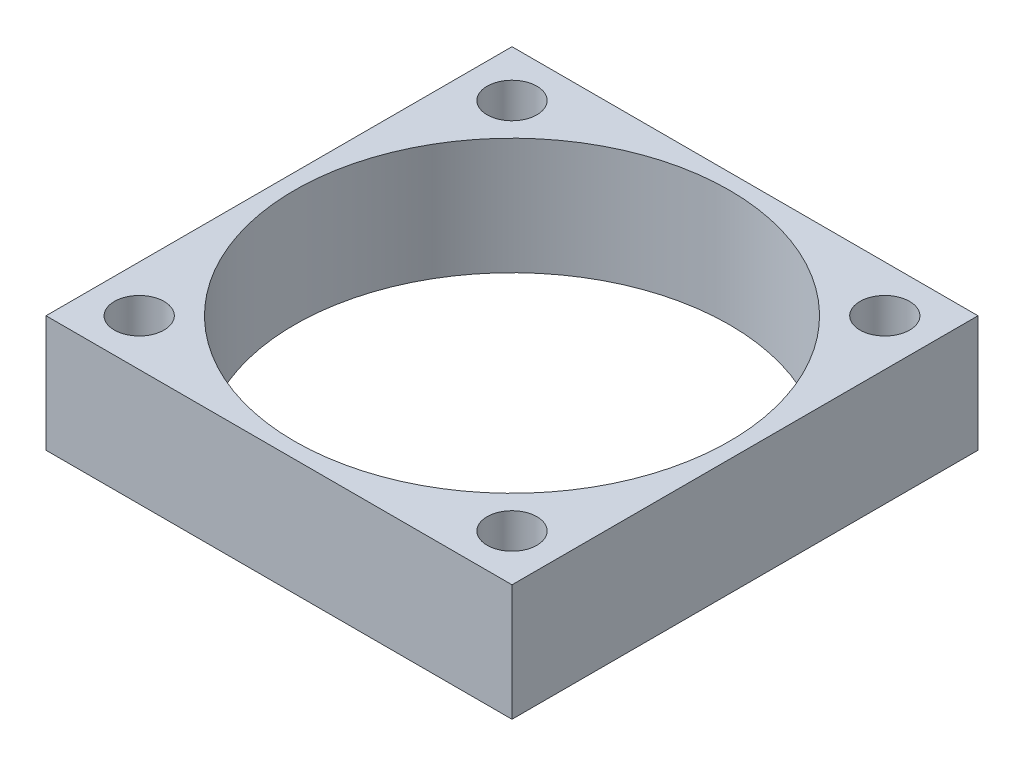
ISO-10303-21;
HEADER;
FILE_DESCRIPTION(('STEP AP214'),'2;1');
FILE_NAME('part.step','',(''),(''),'','','');
FILE_SCHEMA(('AUTOMOTIVE_DESIGN { 1 0 10303 214 1 1 1 1 }'));
ENDSEC;
DATA;
#1=APPLICATION_CONTEXT('core data for automotive mechanical design processes');
#2=APPLICATION_PROTOCOL_DEFINITION('international standard','automotive_design',2000,#1);
#3=PRODUCT_CONTEXT('',#1,'mechanical');
#4=PRODUCT('Part','Part','',(#3));
#5=PRODUCT_RELATED_PRODUCT_CATEGORY('part','',(#4));
#6=PRODUCT_DEFINITION_FORMATION('','',#4);
#7=PRODUCT_DEFINITION_CONTEXT('part definition',#1,'design');
#8=PRODUCT_DEFINITION('design','',#6,#7);
#9=PRODUCT_DEFINITION_SHAPE('','',#8);
#10=(LENGTH_UNIT() NAMED_UNIT(*) SI_UNIT(.MILLI.,.METRE.));
#11=(NAMED_UNIT(*) PLANE_ANGLE_UNIT() SI_UNIT($,.RADIAN.));
#12=(NAMED_UNIT(*) SI_UNIT($,.STERADIAN.) SOLID_ANGLE_UNIT());
#13=UNCERTAINTY_MEASURE_WITH_UNIT(LENGTH_MEASURE(1.E-05),#10,'distance_accuracy_value','');
#14=(GEOMETRIC_REPRESENTATION_CONTEXT(3) GLOBAL_UNCERTAINTY_ASSIGNED_CONTEXT((#13)) GLOBAL_UNIT_ASSIGNED_CONTEXT((#10,
#11,#12)) REPRESENTATION_CONTEXT('',''));
#15=CARTESIAN_POINT('',(0.,0.,0.));
#16=DIRECTION('',(0.,0.,1.));
#17=DIRECTION('',(1.,0.,0.));
#18=AXIS2_PLACEMENT_3D('',#15,#16,#17);
#19=CARTESIAN_POINT('',(0.,7.5,0.));
#20=DIRECTION('',(0.,-1.,0.));
#21=DIRECTION('',(0.,0.,-1.));
#22=AXIS2_PLACEMENT_3D('',#19,#20,#21);
#23=PLANE('',#22);
#24=DIRECTION('',(0.,0.,1.));
#25=VECTOR('',#24,1.);
#26=CARTESIAN_POINT('',(0.,7.5,0.));
#27=LINE('',#26,#25);
#28=CARTESIAN_POINT('',(0.,7.5,-30.));
#29=VERTEX_POINT('',#28);
#30=CARTESIAN_POINT('',(0.,7.5,0.));
#31=VERTEX_POINT('',#30);
#32=EDGE_CURVE('E84',#29,#31,#27,.T.);
#33=ORIENTED_EDGE('',*,*,#32,.T.);
#34=DIRECTION('',(1.,0.,0.));
#35=VECTOR('',#34,1.);
#36=CARTESIAN_POINT('',(0.,7.5,0.));
#37=LINE('',#36,#35);
#38=CARTESIAN_POINT('',(30.,7.5,0.));
#39=VERTEX_POINT('',#38);
#40=EDGE_CURVE('E79',#31,#39,#37,.T.);
#41=ORIENTED_EDGE('',*,*,#40,.T.);
#42=DIRECTION('',(0.,0.,-1.));
#43=VECTOR('',#42,1.);
#44=CARTESIAN_POINT('',(30.,7.5,0.));
#45=LINE('',#44,#43);
#46=CARTESIAN_POINT('',(30.,7.5,-30.));
#47=VERTEX_POINT('',#46);
#48=EDGE_CURVE('E82',#39,#47,#45,.T.);
#49=ORIENTED_EDGE('',*,*,#48,.T.);
#50=DIRECTION('',(-1.,0.,0.));
#51=VECTOR('',#50,1.);
#52=CARTESIAN_POINT('',(0.,7.5,-30.));
#53=LINE('',#52,#51);
#54=EDGE_CURVE('E49',#47,#29,#53,.T.);
#55=ORIENTED_EDGE('',*,*,#54,.T.);
#56=EDGE_LOOP('',(#33,#41,#49,#55));
#57=FACE_BOUND('',#56,.T.);
#58=CARTESIAN_POINT('',(3.,7.5,-27.));
#59=DIRECTION('',(0.,1.,0.));
#60=DIRECTION('',(0.,0.,1.));
#61=AXIS2_PLACEMENT_3D('',#58,#59,#60);
#62=CIRCLE('',#61,1.6);
#63=CARTESIAN_POINT('',(3.,7.5,-25.4));
#64=VERTEX_POINT('',#63);
#65=EDGE_CURVE('E99',#64,#64,#62,.T.);
#66=ORIENTED_EDGE('',*,*,#65,.F.);
#67=EDGE_LOOP('',(#66));
#68=FACE_BOUND('',#67,.T.);
#69=CARTESIAN_POINT('',(27.,7.5,-27.));
#70=DIRECTION('',(0.,1.,0.));
#71=DIRECTION('',(0.,0.,-1.));
#72=AXIS2_PLACEMENT_3D('',#69,#70,#71);
#73=CIRCLE('',#72,1.6);
#74=CARTESIAN_POINT('',(27.,7.5,-28.6));
#75=VERTEX_POINT('',#74);
#76=EDGE_CURVE('E114',#75,#75,#73,.T.);
#77=ORIENTED_EDGE('',*,*,#76,.F.);
#78=EDGE_LOOP('',(#77));
#79=FACE_BOUND('',#78,.T.);
#80=CARTESIAN_POINT('',(27.,7.5,-3.));
#81=DIRECTION('',(0.,1.,0.));
#82=DIRECTION('',(0.,0.,1.));
#83=AXIS2_PLACEMENT_3D('',#80,#81,#82);
#84=CIRCLE('',#83,1.6);
#85=CARTESIAN_POINT('',(27.,7.5,-1.4));
#86=VERTEX_POINT('',#85);
#87=EDGE_CURVE('E120',#86,#86,#84,.T.);
#88=ORIENTED_EDGE('',*,*,#87,.F.);
#89=EDGE_LOOP('',(#88));
#90=FACE_BOUND('',#89,.T.);
#91=CARTESIAN_POINT('',(3.,7.5,-3.));
#92=DIRECTION('',(0.,1.,0.));
#93=DIRECTION('',(0.,0.,-1.));
#94=AXIS2_PLACEMENT_3D('',#91,#92,#93);
#95=CIRCLE('',#94,1.6);
#96=CARTESIAN_POINT('',(3.,7.5,-4.6));
#97=VERTEX_POINT('',#96);
#98=EDGE_CURVE('E126',#97,#97,#95,.T.);
#99=ORIENTED_EDGE('',*,*,#98,.F.);
#100=EDGE_LOOP('',(#99));
#101=FACE_BOUND('',#100,.T.);
#102=CARTESIAN_POINT('',(15.,7.5,-15.));
#103=DIRECTION('',(0.,1.,0.));
#104=DIRECTION('',(0.,0.,1.));
#105=AXIS2_PLACEMENT_3D('',#102,#103,#104);
#106=CIRCLE('',#105,14.);
#107=CARTESIAN_POINT('',(15.,7.5,-1.));
#108=VERTEX_POINT('',#107);
#109=EDGE_CURVE('E132',#108,#108,#106,.T.);
#110=ORIENTED_EDGE('',*,*,#109,.F.);
#111=EDGE_LOOP('',(#110));
#112=FACE_BOUND('',#111,.T.);
#113=ADVANCED_FACE('F32',(#57,#68,#79,#90,#101,#112),#23,.F.);
#114=CARTESIAN_POINT('',(0.,0.,0.));
#115=DIRECTION('',(0.,-1.,0.));
#116=DIRECTION('',(0.,0.,-1.));
#117=AXIS2_PLACEMENT_3D('',#114,#115,#116);
#118=PLANE('',#117);
#119=CARTESIAN_POINT('',(3.,0.,-3.));
#120=DIRECTION('',(0.,1.,0.));
#121=DIRECTION('',(0.,0.,-1.));
#122=AXIS2_PLACEMENT_3D('',#119,#120,#121);
#123=CIRCLE('',#122,1.6);
#124=CARTESIAN_POINT('',(3.,0.,-4.6));
#125=VERTEX_POINT('',#124);
#126=EDGE_CURVE('E129',#125,#125,#123,.T.);
#127=ORIENTED_EDGE('',*,*,#126,.T.);
#128=EDGE_LOOP('',(#127));
#129=FACE_BOUND('',#128,.T.);
#130=CARTESIAN_POINT('',(27.,0.,-27.));
#131=DIRECTION('',(0.,1.,0.));
#132=DIRECTION('',(0.,0.,-1.));
#133=AXIS2_PLACEMENT_3D('',#130,#131,#132);
#134=CIRCLE('',#133,1.6);
#135=CARTESIAN_POINT('',(27.,0.,-28.6));
#136=VERTEX_POINT('',#135);
#137=EDGE_CURVE('E117',#136,#136,#134,.T.);
#138=ORIENTED_EDGE('',*,*,#137,.T.);
#139=EDGE_LOOP('',(#138));
#140=FACE_BOUND('',#139,.T.);
#141=DIRECTION('',(0.,0.,1.));
#142=VECTOR('',#141,1.);
#143=CARTESIAN_POINT('',(0.,0.,0.));
#144=LINE('',#143,#142);
#145=CARTESIAN_POINT('',(0.,0.,-30.));
#146=VERTEX_POINT('',#145);
#147=CARTESIAN_POINT('',(0.,0.,0.));
#148=VERTEX_POINT('',#147);
#149=EDGE_CURVE('E96',#146,#148,#144,.T.);
#150=ORIENTED_EDGE('',*,*,#149,.F.);
#151=DIRECTION('',(-1.,0.,0.));
#152=VECTOR('',#151,1.);
#153=CARTESIAN_POINT('',(0.,0.,-30.));
#154=LINE('',#153,#152);
#155=CARTESIAN_POINT('',(30.,0.,-30.));
#156=VERTEX_POINT('',#155);
#157=EDGE_CURVE('E72',#156,#146,#154,.T.);
#158=ORIENTED_EDGE('',*,*,#157,.F.);
#159=DIRECTION('',(0.,0.,-1.));
#160=VECTOR('',#159,1.);
#161=CARTESIAN_POINT('',(30.,0.,0.));
#162=LINE('',#161,#160);
#163=CARTESIAN_POINT('',(30.,0.,0.));
#164=VERTEX_POINT('',#163);
#165=EDGE_CURVE('E66',#164,#156,#162,.T.);
#166=ORIENTED_EDGE('',*,*,#165,.F.);
#167=DIRECTION('',(1.,0.,0.));
#168=VECTOR('',#167,1.);
#169=CARTESIAN_POINT('',(0.,0.,0.));
#170=LINE('',#169,#168);
#171=EDGE_CURVE('E88',#148,#164,#170,.T.);
#172=ORIENTED_EDGE('',*,*,#171,.F.);
#173=EDGE_LOOP('',(#150,#158,#166,#172));
#174=FACE_BOUND('',#173,.T.);
#175=CARTESIAN_POINT('',(3.,0.,-27.));
#176=DIRECTION('',(0.,1.,0.));
#177=DIRECTION('',(0.,0.,1.));
#178=AXIS2_PLACEMENT_3D('',#175,#176,#177);
#179=CIRCLE('',#178,1.6);
#180=CARTESIAN_POINT('',(3.,0.,-25.4));
#181=VERTEX_POINT('',#180);
#182=EDGE_CURVE('E111',#181,#181,#179,.T.);
#183=ORIENTED_EDGE('',*,*,#182,.T.);
#184=EDGE_LOOP('',(#183));
#185=FACE_BOUND('',#184,.T.);
#186=CARTESIAN_POINT('',(27.,0.,-3.));
#187=DIRECTION('',(0.,1.,0.));
#188=DIRECTION('',(0.,0.,1.));
#189=AXIS2_PLACEMENT_3D('',#186,#187,#188);
#190=CIRCLE('',#189,1.6);
#191=CARTESIAN_POINT('',(27.,0.,-1.4));
#192=VERTEX_POINT('',#191);
#193=EDGE_CURVE('E123',#192,#192,#190,.T.);
#194=ORIENTED_EDGE('',*,*,#193,.T.);
#195=EDGE_LOOP('',(#194));
#196=FACE_BOUND('',#195,.T.);
#197=CARTESIAN_POINT('',(15.,0.,-15.));
#198=DIRECTION('',(0.,1.,0.));
#199=DIRECTION('',(0.,0.,1.));
#200=AXIS2_PLACEMENT_3D('',#197,#198,#199);
#201=CIRCLE('',#200,14.);
#202=CARTESIAN_POINT('',(15.,0.,-1.));
#203=VERTEX_POINT('',#202);
#204=EDGE_CURVE('E135',#203,#203,#201,.T.);
#205=ORIENTED_EDGE('',*,*,#204,.T.);
#206=EDGE_LOOP('',(#205));
#207=FACE_BOUND('',#206,.T.);
#208=ADVANCED_FACE('F107',(#129,#140,#174,#185,#196,#207),#118,.T.);
#209=CARTESIAN_POINT('',(0.,7.5,0.));
#210=DIRECTION('',(1.,0.,0.));
#211=DIRECTION('',(0.,0.,-1.));
#212=AXIS2_PLACEMENT_3D('',#209,#210,#211);
#213=PLANE('',#212);
#214=ORIENTED_EDGE('',*,*,#149,.T.);
#215=DIRECTION('',(0.,-1.,0.));
#216=VECTOR('',#215,1.);
#217=CARTESIAN_POINT('',(0.,7.5,0.));
#218=LINE('',#217,#216);
#219=EDGE_CURVE('E11',#31,#148,#218,.T.);
#220=ORIENTED_EDGE('',*,*,#219,.F.);
#221=ORIENTED_EDGE('',*,*,#32,.F.);
#222=DIRECTION('',(0.,-1.,0.));
#223=VECTOR('',#222,1.);
#224=CARTESIAN_POINT('',(0.,7.5,-30.));
#225=LINE('',#224,#223);
#226=EDGE_CURVE('E92',#29,#146,#225,.T.);
#227=ORIENTED_EDGE('',*,*,#226,.T.);
#228=EDGE_LOOP('',(#214,#220,#221,#227));
#229=FACE_BOUND('',#228,.T.);
#230=ADVANCED_FACE('F34',(#229),#213,.F.);
#231=CARTESIAN_POINT('',(0.,7.5,0.));
#232=DIRECTION('',(0.,0.,-1.));
#233=DIRECTION('',(-1.,0.,0.));
#234=AXIS2_PLACEMENT_3D('',#231,#232,#233);
#235=PLANE('',#234);
#236=ORIENTED_EDGE('',*,*,#171,.T.);
#237=DIRECTION('',(0.,-1.,0.));
#238=VECTOR('',#237,1.);
#239=CARTESIAN_POINT('',(30.,7.5,0.));
#240=LINE('',#239,#238);
#241=EDGE_CURVE('E41',#39,#164,#240,.T.);
#242=ORIENTED_EDGE('',*,*,#241,.F.);
#243=ORIENTED_EDGE('',*,*,#40,.F.);
#244=ORIENTED_EDGE('',*,*,#219,.T.);
#245=EDGE_LOOP('',(#236,#242,#243,#244));
#246=FACE_BOUND('',#245,.T.);
#247=ADVANCED_FACE('F87',(#246),#235,.F.);
#248=CARTESIAN_POINT('',(30.,7.5,0.));
#249=DIRECTION('',(-1.,0.,0.));
#250=DIRECTION('',(0.,0.,1.));
#251=AXIS2_PLACEMENT_3D('',#248,#249,#250);
#252=PLANE('',#251);
#253=ORIENTED_EDGE('',*,*,#165,.T.);
#254=DIRECTION('',(0.,-1.,0.));
#255=VECTOR('',#254,1.);
#256=CARTESIAN_POINT('',(30.,7.5,-30.));
#257=LINE('',#256,#255);
#258=EDGE_CURVE('E89',#47,#156,#257,.T.);
#259=ORIENTED_EDGE('',*,*,#258,.F.);
#260=ORIENTED_EDGE('',*,*,#48,.F.);
#261=ORIENTED_EDGE('',*,*,#241,.T.);
#262=EDGE_LOOP('',(#253,#259,#260,#261));
#263=FACE_BOUND('',#262,.T.);
#264=ADVANCED_FACE('F90',(#263),#252,.F.);
#265=CARTESIAN_POINT('',(0.,7.5,-30.));
#266=DIRECTION('',(0.,0.,1.));
#267=DIRECTION('',(1.,0.,0.));
#268=AXIS2_PLACEMENT_3D('',#265,#266,#267);
#269=PLANE('',#268);
#270=ORIENTED_EDGE('',*,*,#157,.T.);
#271=ORIENTED_EDGE('',*,*,#226,.F.);
#272=ORIENTED_EDGE('',*,*,#54,.F.);
#273=ORIENTED_EDGE('',*,*,#258,.T.);
#274=EDGE_LOOP('',(#270,#271,#272,#273));
#275=FACE_BOUND('',#274,.T.);
#276=ADVANCED_FACE('F104',(#275),#269,.F.);
#277=CARTESIAN_POINT('',(3.,7.5,-27.));
#278=DIRECTION('',(0.,-1.,0.));
#279=DIRECTION('',(0.,0.,-1.));
#280=AXIS2_PLACEMENT_3D('',#277,#278,#279);
#281=CYLINDRICAL_SURFACE('',#280,1.6);
#282=ORIENTED_EDGE('',*,*,#65,.T.);
#283=EDGE_LOOP('',(#282));
#284=FACE_BOUND('',#283,.T.);
#285=ORIENTED_EDGE('',*,*,#182,.F.);
#286=EDGE_LOOP('',(#285));
#287=FACE_BOUND('',#286,.T.);
#288=ADVANCED_FACE('F152',(#284,#287),#281,.F.);
#289=CARTESIAN_POINT('',(27.,7.5,-27.));
#290=DIRECTION('',(0.,-1.,0.));
#291=DIRECTION('',(0.,0.,-1.));
#292=AXIS2_PLACEMENT_3D('',#289,#290,#291);
#293=CYLINDRICAL_SURFACE('',#292,1.6);
#294=ORIENTED_EDGE('',*,*,#76,.T.);
#295=EDGE_LOOP('',(#294));
#296=FACE_BOUND('',#295,.T.);
#297=ORIENTED_EDGE('',*,*,#137,.F.);
#298=EDGE_LOOP('',(#297));
#299=FACE_BOUND('',#298,.T.);
#300=ADVANCED_FACE('F198',(#296,#299),#293,.F.);
#301=CARTESIAN_POINT('',(27.,7.5,-3.));
#302=DIRECTION('',(0.,-1.,0.));
#303=DIRECTION('',(0.,0.,-1.));
#304=AXIS2_PLACEMENT_3D('',#301,#302,#303);
#305=CYLINDRICAL_SURFACE('',#304,1.6);
#306=ORIENTED_EDGE('',*,*,#87,.T.);
#307=EDGE_LOOP('',(#306));
#308=FACE_BOUND('',#307,.T.);
#309=ORIENTED_EDGE('',*,*,#193,.F.);
#310=EDGE_LOOP('',(#309));
#311=FACE_BOUND('',#310,.T.);
#312=ADVANCED_FACE('F206',(#308,#311),#305,.F.);
#313=CARTESIAN_POINT('',(3.,7.5,-3.));
#314=DIRECTION('',(0.,-1.,0.));
#315=DIRECTION('',(0.,0.,-1.));
#316=AXIS2_PLACEMENT_3D('',#313,#314,#315);
#317=CYLINDRICAL_SURFACE('',#316,1.6);
#318=ORIENTED_EDGE('',*,*,#98,.T.);
#319=EDGE_LOOP('',(#318));
#320=FACE_BOUND('',#319,.T.);
#321=ORIENTED_EDGE('',*,*,#126,.F.);
#322=EDGE_LOOP('',(#321));
#323=FACE_BOUND('',#322,.T.);
#324=ADVANCED_FACE('F214',(#320,#323),#317,.F.);
#325=CARTESIAN_POINT('',(15.,7.5,-15.));
#326=DIRECTION('',(0.,-1.,0.));
#327=DIRECTION('',(0.,0.,-1.));
#328=AXIS2_PLACEMENT_3D('',#325,#326,#327);
#329=CYLINDRICAL_SURFACE('',#328,14.);
#330=ORIENTED_EDGE('',*,*,#109,.T.);
#331=EDGE_LOOP('',(#330));
#332=FACE_BOUND('',#331,.T.);
#333=ORIENTED_EDGE('',*,*,#204,.F.);
#334=EDGE_LOOP('',(#333));
#335=FACE_BOUND('',#334,.T.);
#336=ADVANCED_FACE('F141',(#332,#335),#329,.F.);
#337=CLOSED_SHELL('',(#113,#208,#230,#247,#264,#276,#288,#300,#312,#324,#336));
#338=MANIFOLD_SOLID_BREP('B2',#337);
#339=ADVANCED_BREP_SHAPE_REPRESENTATION('',(#18,#338),#14);
#340=SHAPE_DEFINITION_REPRESENTATION(#9,#339);
ENDSEC;
END-ISO-10303-21;
